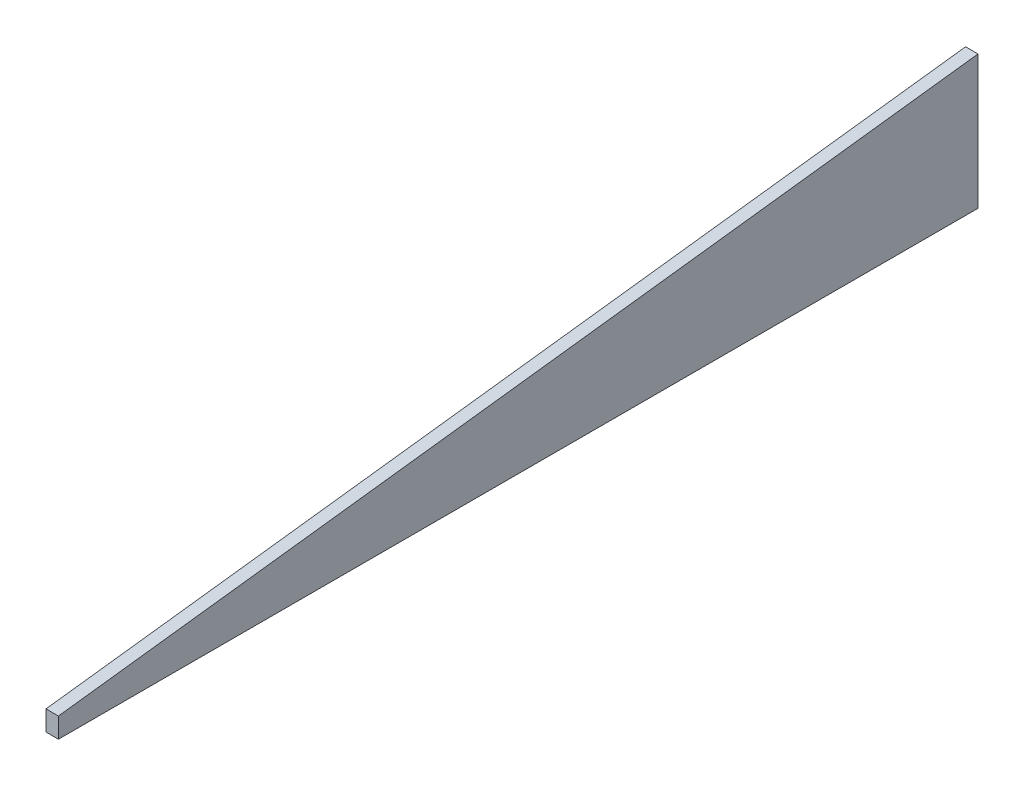
ISO-10303-21;
HEADER;
FILE_DESCRIPTION(('STEP AP214'),'2;1');
FILE_NAME('part.step','',(''),(''),'','','');
FILE_SCHEMA(('AUTOMOTIVE_DESIGN { 1 0 10303 214 1 1 1 1 }'));
ENDSEC;
DATA;
#1=APPLICATION_CONTEXT('core data for automotive mechanical design processes');
#2=APPLICATION_PROTOCOL_DEFINITION('international standard','automotive_design',2000,#1);
#3=PRODUCT_CONTEXT('',#1,'mechanical');
#4=PRODUCT('Part','Part','',(#3));
#5=PRODUCT_RELATED_PRODUCT_CATEGORY('part','',(#4));
#6=PRODUCT_DEFINITION_FORMATION('','',#4);
#7=PRODUCT_DEFINITION_CONTEXT('part definition',#1,'design');
#8=PRODUCT_DEFINITION('design','',#6,#7);
#9=PRODUCT_DEFINITION_SHAPE('','',#8);
#10=(LENGTH_UNIT() NAMED_UNIT(*) SI_UNIT(.MILLI.,.METRE.));
#11=(NAMED_UNIT(*) PLANE_ANGLE_UNIT() SI_UNIT($,.RADIAN.));
#12=(NAMED_UNIT(*) SI_UNIT($,.STERADIAN.) SOLID_ANGLE_UNIT());
#13=UNCERTAINTY_MEASURE_WITH_UNIT(LENGTH_MEASURE(1.E-05),#10,'distance_accuracy_value','');
#14=(GEOMETRIC_REPRESENTATION_CONTEXT(3) GLOBAL_UNCERTAINTY_ASSIGNED_CONTEXT((#13)) GLOBAL_UNIT_ASSIGNED_CONTEXT((#10,
#11,#12)) REPRESENTATION_CONTEXT('',''));
#15=CARTESIAN_POINT('',(0.,0.,0.));
#16=DIRECTION('',(0.,0.,1.));
#17=DIRECTION('',(1.,0.,0.));
#18=AXIS2_PLACEMENT_3D('',#15,#16,#17);
#19=CARTESIAN_POINT('',(12.7,0.,0.));
#20=DIRECTION('',(1.,0.,0.));
#21=DIRECTION('',(0.,0.,-1.));
#22=AXIS2_PLACEMENT_3D('',#19,#20,#21);
#23=PLANE('',#22);
#24=DIRECTION('',(0.,1.,0.));
#25=VECTOR('',#24,1.);
#26=CARTESIAN_POINT('',(12.7,0.,-1106.01595051917));
#27=LINE('',#26,#25);
#28=CARTESIAN_POINT('',(12.7,136.644787029641,-1106.01595051917));
#29=VERTEX_POINT('',#28);
#30=CARTESIAN_POINT('',(12.7,0.,-1106.01595051917));
#31=VERTEX_POINT('',#30);
#32=EDGE_CURVE('E68',#29,#31,#27,.F.);
#33=ORIENTED_EDGE('',*,*,#32,.F.);
#34=DIRECTION('',(0.,-0.122614610251596,0.992454360337466));
#35=VECTOR('',#34,1.);
#36=CARTESIAN_POINT('',(12.7,136.644787029641,-1106.01595051917));
#37=LINE('',#36,#35);
#38=CARTESIAN_POINT('',(12.7,20.5354571504572,-166.215950519073));
#39=VERTEX_POINT('',#38);
#40=EDGE_CURVE('E20',#39,#29,#37,.F.);
#41=ORIENTED_EDGE('',*,*,#40,.F.);
#42=DIRECTION('',(0.,1.,0.));
#43=VECTOR('',#42,1.);
#44=CARTESIAN_POINT('',(12.7,20.535457150459,-166.215950519072));
#45=LINE('',#44,#43);
#46=CARTESIAN_POINT('',(12.7,0.,-166.215950519072));
#47=VERTEX_POINT('',#46);
#48=EDGE_CURVE('E58',#47,#39,#45,.T.);
#49=ORIENTED_EDGE('',*,*,#48,.F.);
#50=DIRECTION('',(0.,0.,-1.));
#51=VECTOR('',#50,1.);
#52=CARTESIAN_POINT('',(12.7,0.,-166.215950519072));
#53=LINE('',#52,#51);
#54=EDGE_CURVE('E53',#31,#47,#53,.F.);
#55=ORIENTED_EDGE('',*,*,#54,.F.);
#56=EDGE_LOOP('',(#33,#41,#49,#55));
#57=FACE_BOUND('',#56,.T.);
#58=ADVANCED_FACE('F17',(#57),#23,.T.);
#59=CARTESIAN_POINT('',(0.,136.644787029641,-1106.01595051917));
#60=DIRECTION('',(0.,0.992454360337466,0.122614610251596));
#61=DIRECTION('',(0.,-0.122614610251596,0.992454360337466));
#62=AXIS2_PLACEMENT_3D('',#59,#60,#61);
#63=PLANE('',#62);
#64=DIRECTION('',(-1.,0.,0.));
#65=VECTOR('',#64,1.);
#66=CARTESIAN_POINT('',(0.,136.644787029641,-1106.01595051917));
#67=LINE('',#66,#65);
#68=CARTESIAN_POINT('',(0.,136.644787029641,-1106.01595051917));
#69=VERTEX_POINT('',#68);
#70=EDGE_CURVE('E79',#69,#29,#67,.F.);
#71=ORIENTED_EDGE('',*,*,#70,.F.);
#72=DIRECTION('',(0.,-0.122614610251588,0.992454360337467));
#73=VECTOR('',#72,1.);
#74=CARTESIAN_POINT('',(0.,136.644787029641,-1106.01595051917));
#75=LINE('',#74,#73);
#76=CARTESIAN_POINT('',(0.,20.5354571504554,-166.215950519073));
#77=VERTEX_POINT('',#76);
#78=EDGE_CURVE('E74',#69,#77,#75,.T.);
#79=ORIENTED_EDGE('',*,*,#78,.T.);
#80=DIRECTION('',(1.,0.,0.));
#81=VECTOR('',#80,1.);
#82=CARTESIAN_POINT('',(0.,20.535457150459,-166.215950519072));
#83=LINE('',#82,#81);
#84=EDGE_CURVE('E63',#39,#77,#83,.F.);
#85=ORIENTED_EDGE('',*,*,#84,.F.);
#86=ORIENTED_EDGE('',*,*,#40,.T.);
#87=EDGE_LOOP('',(#71,#79,#85,#86));
#88=FACE_BOUND('',#87,.T.);
#89=ADVANCED_FACE('F73',(#88),#63,.T.);
#90=CARTESIAN_POINT('',(0.,20.535457150459,-166.215950519072));
#91=DIRECTION('',(0.,0.,1.));
#92=DIRECTION('',(1.,0.,0.));
#93=AXIS2_PLACEMENT_3D('',#90,#91,#92);
#94=PLANE('',#93);
#95=ORIENTED_EDGE('',*,*,#84,.T.);
#96=DIRECTION('',(0.,1.,0.));
#97=VECTOR('',#96,1.);
#98=CARTESIAN_POINT('',(0.,0.,-166.215950519072));
#99=LINE('',#98,#97);
#100=CARTESIAN_POINT('',(0.,0.,-166.215950519072));
#101=VERTEX_POINT('',#100);
#102=EDGE_CURVE('E84',#77,#101,#99,.F.);
#103=ORIENTED_EDGE('',*,*,#102,.T.);
#104=DIRECTION('',(1.,0.,0.));
#105=VECTOR('',#104,1.);
#106=CARTESIAN_POINT('',(0.,0.,-166.215950519072));
#107=LINE('',#106,#105);
#108=EDGE_CURVE('E65',#47,#101,#107,.F.);
#109=ORIENTED_EDGE('',*,*,#108,.F.);
#110=ORIENTED_EDGE('',*,*,#48,.T.);
#111=EDGE_LOOP('',(#95,#103,#109,#110));
#112=FACE_BOUND('',#111,.T.);
#113=ADVANCED_FACE('F60',(#112),#94,.T.);
#114=CARTESIAN_POINT('',(0.,0.,-166.215950519072));
#115=DIRECTION('',(0.,-1.,0.));
#116=DIRECTION('',(0.,0.,-1.));
#117=AXIS2_PLACEMENT_3D('',#114,#115,#116);
#118=PLANE('',#117);
#119=ORIENTED_EDGE('',*,*,#108,.T.);
#120=DIRECTION('',(0.,0.,-1.));
#121=VECTOR('',#120,1.);
#122=CARTESIAN_POINT('',(0.,0.,0.));
#123=LINE('',#122,#121);
#124=CARTESIAN_POINT('',(0.,0.,-1106.01595051917));
#125=VERTEX_POINT('',#124);
#126=EDGE_CURVE('E26',#101,#125,#123,.T.);
#127=ORIENTED_EDGE('',*,*,#126,.T.);
#128=DIRECTION('',(-1.,0.,0.));
#129=VECTOR('',#128,1.);
#130=CARTESIAN_POINT('',(0.,0.,-1106.01595051917));
#131=LINE('',#130,#129);
#132=EDGE_CURVE('E34',#31,#125,#131,.T.);
#133=ORIENTED_EDGE('',*,*,#132,.F.);
#134=ORIENTED_EDGE('',*,*,#54,.T.);
#135=EDGE_LOOP('',(#119,#127,#133,#134));
#136=FACE_BOUND('',#135,.T.);
#137=ADVANCED_FACE('F88',(#136),#118,.T.);
#138=CARTESIAN_POINT('',(0.,0.,-1106.01595051917));
#139=DIRECTION('',(0.,0.,-1.));
#140=DIRECTION('',(-1.,0.,0.));
#141=AXIS2_PLACEMENT_3D('',#138,#139,#140);
#142=PLANE('',#141);
#143=ORIENTED_EDGE('',*,*,#132,.T.);
#144=DIRECTION('',(0.,1.,0.));
#145=VECTOR('',#144,1.);
#146=CARTESIAN_POINT('',(0.,0.,-1106.01595051917));
#147=LINE('',#146,#145);
#148=EDGE_CURVE('E11',#125,#69,#147,.T.);
#149=ORIENTED_EDGE('',*,*,#148,.T.);
#150=ORIENTED_EDGE('',*,*,#70,.T.);
#151=ORIENTED_EDGE('',*,*,#32,.T.);
#152=EDGE_LOOP('',(#143,#149,#150,#151));
#153=FACE_BOUND('',#152,.T.);
#154=ADVANCED_FACE('F91',(#153),#142,.T.);
#155=CARTESIAN_POINT('',(0.,0.,0.));
#156=DIRECTION('',(1.,0.,0.));
#157=DIRECTION('',(0.,0.,-1.));
#158=AXIS2_PLACEMENT_3D('',#155,#156,#157);
#159=PLANE('',#158);
#160=ORIENTED_EDGE('',*,*,#126,.F.);
#161=ORIENTED_EDGE('',*,*,#102,.F.);
#162=ORIENTED_EDGE('',*,*,#78,.F.);
#163=ORIENTED_EDGE('',*,*,#148,.F.);
#164=EDGE_LOOP('',(#160,#161,#162,#163));
#165=FACE_BOUND('',#164,.T.);
#166=ADVANCED_FACE('F90',(#165),#159,.F.);
#167=CLOSED_SHELL('',(#58,#89,#113,#137,#154,#166));
#168=MANIFOLD_SOLID_BREP('B1',#167);
#169=ADVANCED_BREP_SHAPE_REPRESENTATION('',(#18,#168),#14);
#170=SHAPE_DEFINITION_REPRESENTATION(#9,#169);
ENDSEC;
END-ISO-10303-21;
